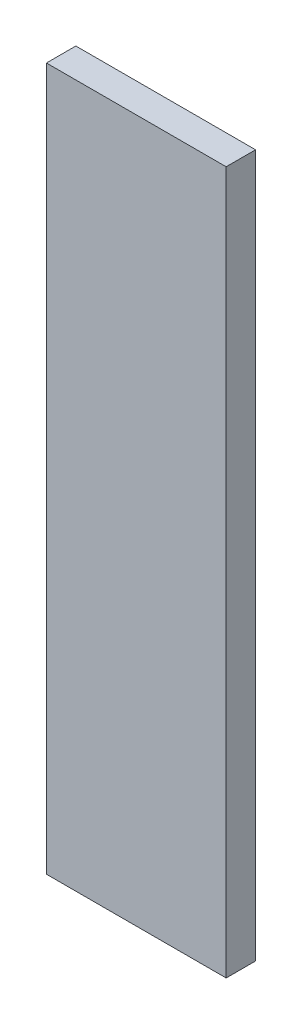
ISO-10303-21;
HEADER;
FILE_DESCRIPTION(('STEP AP214'),'2;1');
FILE_NAME('part.step','',(''),(''),'','','');
FILE_SCHEMA(('AUTOMOTIVE_DESIGN { 1 0 10303 214 1 1 1 1 }'));
ENDSEC;
DATA;
#1=APPLICATION_CONTEXT('core data for automotive mechanical design processes');
#2=APPLICATION_PROTOCOL_DEFINITION('international standard','automotive_design',2000,#1);
#3=PRODUCT_CONTEXT('',#1,'mechanical');
#4=PRODUCT('Part','Part','',(#3));
#5=PRODUCT_RELATED_PRODUCT_CATEGORY('part','',(#4));
#6=PRODUCT_DEFINITION_FORMATION('','',#4);
#7=PRODUCT_DEFINITION_CONTEXT('part definition',#1,'design');
#8=PRODUCT_DEFINITION('design','',#6,#7);
#9=PRODUCT_DEFINITION_SHAPE('','',#8);
#10=(LENGTH_UNIT() NAMED_UNIT(*) SI_UNIT(.MILLI.,.METRE.));
#11=(NAMED_UNIT(*) PLANE_ANGLE_UNIT() SI_UNIT($,.RADIAN.));
#12=(NAMED_UNIT(*) SI_UNIT($,.STERADIAN.) SOLID_ANGLE_UNIT());
#13=UNCERTAINTY_MEASURE_WITH_UNIT(LENGTH_MEASURE(1.E-05),#10,'distance_accuracy_value','');
#14=(GEOMETRIC_REPRESENTATION_CONTEXT(3) GLOBAL_UNCERTAINTY_ASSIGNED_CONTEXT((#13)) GLOBAL_UNIT_ASSIGNED_CONTEXT((#10,
#11,#12)) REPRESENTATION_CONTEXT('',''));
#15=CARTESIAN_POINT('',(0.,0.,0.));
#16=DIRECTION('',(0.,0.,1.));
#17=DIRECTION('',(1.,0.,0.));
#18=AXIS2_PLACEMENT_3D('',#15,#16,#17);
#19=CARTESIAN_POINT('',(55.,215.,18.));
#20=DIRECTION('',(-1.,0.,0.));
#21=DIRECTION('',(0.,-1.,0.));
#22=AXIS2_PLACEMENT_3D('',#19,#20,#21);
#23=PLANE('',#22);
#24=DIRECTION('',(0.,1.,0.));
#25=VECTOR('',#24,1.);
#26=CARTESIAN_POINT('',(55.,215.,0.));
#27=LINE('',#26,#25);
#28=CARTESIAN_POINT('',(55.,-215.,0.));
#29=VERTEX_POINT('',#28);
#30=CARTESIAN_POINT('',(55.,215.,0.));
#31=VERTEX_POINT('',#30);
#32=EDGE_CURVE('E96',#29,#31,#27,.T.);
#33=ORIENTED_EDGE('',*,*,#32,.T.);
#34=DIRECTION('',(0.,0.,-1.));
#35=VECTOR('',#34,1.);
#36=CARTESIAN_POINT('',(55.,215.,18.));
#37=LINE('',#36,#35);
#38=CARTESIAN_POINT('',(55.,215.,18.));
#39=VERTEX_POINT('',#38);
#40=EDGE_CURVE('E11',#39,#31,#37,.T.);
#41=ORIENTED_EDGE('',*,*,#40,.F.);
#42=DIRECTION('',(0.,1.,0.));
#43=VECTOR('',#42,1.);
#44=CARTESIAN_POINT('',(55.,215.,18.));
#45=LINE('',#44,#43);
#46=CARTESIAN_POINT('',(55.,-215.,18.));
#47=VERTEX_POINT('',#46);
#48=EDGE_CURVE('E84',#47,#39,#45,.T.);
#49=ORIENTED_EDGE('',*,*,#48,.F.);
#50=DIRECTION('',(0.,0.,-1.));
#51=VECTOR('',#50,1.);
#52=CARTESIAN_POINT('',(55.,-215.,18.));
#53=LINE('',#52,#51);
#54=EDGE_CURVE('E92',#47,#29,#53,.T.);
#55=ORIENTED_EDGE('',*,*,#54,.T.);
#56=EDGE_LOOP('',(#33,#41,#49,#55));
#57=FACE_BOUND('',#56,.T.);
#58=ADVANCED_FACE('F33',(#57),#23,.F.);
#59=CARTESIAN_POINT('',(-55.,215.,18.));
#60=DIRECTION('',(0.,-1.,0.));
#61=DIRECTION('',(0.,0.,-1.));
#62=AXIS2_PLACEMENT_3D('',#59,#60,#61);
#63=PLANE('',#62);
#64=DIRECTION('',(-1.,0.,0.));
#65=VECTOR('',#64,1.);
#66=CARTESIAN_POINT('',(-55.,215.,0.));
#67=LINE('',#66,#65);
#68=CARTESIAN_POINT('',(-55.,215.,0.));
#69=VERTEX_POINT('',#68);
#70=EDGE_CURVE('E88',#31,#69,#67,.T.);
#71=ORIENTED_EDGE('',*,*,#70,.T.);
#72=DIRECTION('',(0.,0.,-1.));
#73=VECTOR('',#72,1.);
#74=CARTESIAN_POINT('',(-55.,215.,18.));
#75=LINE('',#74,#73);
#76=CARTESIAN_POINT('',(-55.,215.,18.));
#77=VERTEX_POINT('',#76);
#78=EDGE_CURVE('E41',#77,#69,#75,.T.);
#79=ORIENTED_EDGE('',*,*,#78,.F.);
#80=DIRECTION('',(-1.,0.,0.));
#81=VECTOR('',#80,1.);
#82=CARTESIAN_POINT('',(-55.,215.,18.));
#83=LINE('',#82,#81);
#84=EDGE_CURVE('E79',#39,#77,#83,.T.);
#85=ORIENTED_EDGE('',*,*,#84,.F.);
#86=ORIENTED_EDGE('',*,*,#40,.T.);
#87=EDGE_LOOP('',(#71,#79,#85,#86));
#88=FACE_BOUND('',#87,.T.);
#89=ADVANCED_FACE('F87',(#88),#63,.F.);
#90=CARTESIAN_POINT('',(-55.,215.,18.));
#91=DIRECTION('',(1.,0.,0.));
#92=DIRECTION('',(0.,1.,0.));
#93=AXIS2_PLACEMENT_3D('',#90,#91,#92);
#94=PLANE('',#93);
#95=DIRECTION('',(0.,-1.,0.));
#96=VECTOR('',#95,1.);
#97=CARTESIAN_POINT('',(-55.,215.,0.));
#98=LINE('',#97,#96);
#99=CARTESIAN_POINT('',(-55.,-215.,0.));
#100=VERTEX_POINT('',#99);
#101=EDGE_CURVE('E66',#69,#100,#98,.T.);
#102=ORIENTED_EDGE('',*,*,#101,.T.);
#103=DIRECTION('',(0.,0.,-1.));
#104=VECTOR('',#103,1.);
#105=CARTESIAN_POINT('',(-55.,-215.,18.));
#106=LINE('',#105,#104);
#107=CARTESIAN_POINT('',(-55.,-215.,18.));
#108=VERTEX_POINT('',#107);
#109=EDGE_CURVE('E89',#108,#100,#106,.T.);
#110=ORIENTED_EDGE('',*,*,#109,.F.);
#111=DIRECTION('',(0.,-1.,0.));
#112=VECTOR('',#111,1.);
#113=CARTESIAN_POINT('',(-55.,215.,18.));
#114=LINE('',#113,#112);
#115=EDGE_CURVE('E82',#77,#108,#114,.T.);
#116=ORIENTED_EDGE('',*,*,#115,.F.);
#117=ORIENTED_EDGE('',*,*,#78,.T.);
#118=EDGE_LOOP('',(#102,#110,#116,#117));
#119=FACE_BOUND('',#118,.T.);
#120=ADVANCED_FACE('F90',(#119),#94,.F.);
#121=CARTESIAN_POINT('',(-55.,-215.,18.));
#122=DIRECTION('',(0.,1.,0.));
#123=DIRECTION('',(0.,0.,1.));
#124=AXIS2_PLACEMENT_3D('',#121,#122,#123);
#125=PLANE('',#124);
#126=DIRECTION('',(1.,0.,0.));
#127=VECTOR('',#126,1.);
#128=CARTESIAN_POINT('',(-55.,-215.,0.));
#129=LINE('',#128,#127);
#130=EDGE_CURVE('E72',#100,#29,#129,.T.);
#131=ORIENTED_EDGE('',*,*,#130,.T.);
#132=ORIENTED_EDGE('',*,*,#54,.F.);
#133=DIRECTION('',(1.,0.,0.));
#134=VECTOR('',#133,1.);
#135=CARTESIAN_POINT('',(-55.,-215.,18.));
#136=LINE('',#135,#134);
#137=EDGE_CURVE('E49',#108,#47,#136,.T.);
#138=ORIENTED_EDGE('',*,*,#137,.F.);
#139=ORIENTED_EDGE('',*,*,#109,.T.);
#140=EDGE_LOOP('',(#131,#132,#138,#139));
#141=FACE_BOUND('',#140,.T.);
#142=ADVANCED_FACE('F103',(#141),#125,.F.);
#143=CARTESIAN_POINT('',(0.,0.,18.));
#144=DIRECTION('',(0.,0.,1.));
#145=DIRECTION('',(1.,0.,0.));
#146=AXIS2_PLACEMENT_3D('',#143,#144,#145);
#147=PLANE('',#146);
#148=ORIENTED_EDGE('',*,*,#48,.T.);
#149=ORIENTED_EDGE('',*,*,#84,.T.);
#150=ORIENTED_EDGE('',*,*,#115,.T.);
#151=ORIENTED_EDGE('',*,*,#137,.T.);
#152=EDGE_LOOP('',(#148,#149,#150,#151));
#153=FACE_BOUND('',#152,.T.);
#154=ADVANCED_FACE('F80',(#153),#147,.T.);
#155=CARTESIAN_POINT('',(0.,0.,0.));
#156=DIRECTION('',(0.,0.,1.));
#157=DIRECTION('',(1.,0.,0.));
#158=AXIS2_PLACEMENT_3D('',#155,#156,#157);
#159=PLANE('',#158);
#160=ORIENTED_EDGE('',*,*,#32,.F.);
#161=ORIENTED_EDGE('',*,*,#130,.F.);
#162=ORIENTED_EDGE('',*,*,#101,.F.);
#163=ORIENTED_EDGE('',*,*,#70,.F.);
#164=EDGE_LOOP('',(#160,#161,#162,#163));
#165=FACE_BOUND('',#164,.T.);
#166=ADVANCED_FACE('F106',(#165),#159,.F.);
#167=CLOSED_SHELL('',(#58,#89,#120,#142,#154,#166));
#168=MANIFOLD_SOLID_BREP('B2',#167);
#169=ADVANCED_BREP_SHAPE_REPRESENTATION('',(#18,#168),#14);
#170=SHAPE_DEFINITION_REPRESENTATION(#9,#169);
ENDSEC;
END-ISO-10303-21;
